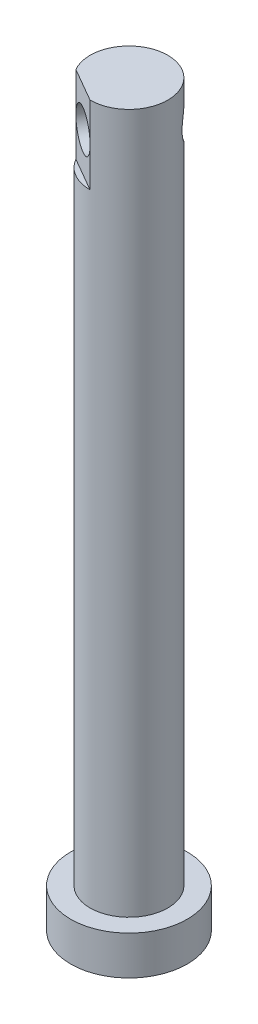
ISO-10303-21;
HEADER;
FILE_DESCRIPTION(('STEP AP214'),'2;1');
FILE_NAME('part.step','',(''),(''),'','','');
FILE_SCHEMA(('AUTOMOTIVE_DESIGN { 1 0 10303 214 1 1 1 1 }'));
ENDSEC;
DATA;
#1=APPLICATION_CONTEXT('core data for automotive mechanical design processes');
#2=APPLICATION_PROTOCOL_DEFINITION('international standard','automotive_design',2000,#1);
#3=PRODUCT_CONTEXT('',#1,'mechanical');
#4=PRODUCT('Part','Part','',(#3));
#5=PRODUCT_RELATED_PRODUCT_CATEGORY('part','',(#4));
#6=PRODUCT_DEFINITION_FORMATION('','',#4);
#7=PRODUCT_DEFINITION_CONTEXT('part definition',#1,'design');
#8=PRODUCT_DEFINITION('design','',#6,#7);
#9=PRODUCT_DEFINITION_SHAPE('','',#8);
#10=(LENGTH_UNIT() NAMED_UNIT(*) SI_UNIT(.MILLI.,.METRE.));
#11=(NAMED_UNIT(*) PLANE_ANGLE_UNIT() SI_UNIT($,.RADIAN.));
#12=(NAMED_UNIT(*) SI_UNIT($,.STERADIAN.) SOLID_ANGLE_UNIT());
#13=UNCERTAINTY_MEASURE_WITH_UNIT(LENGTH_MEASURE(1.E-05),#10,'distance_accuracy_value','');
#14=(GEOMETRIC_REPRESENTATION_CONTEXT(3) GLOBAL_UNCERTAINTY_ASSIGNED_CONTEXT((#13)) GLOBAL_UNIT_ASSIGNED_CONTEXT((#10,
#11,#12)) REPRESENTATION_CONTEXT('',''));
#15=CARTESIAN_POINT('',(0.,0.,0.));
#16=DIRECTION('',(0.,0.,1.));
#17=DIRECTION('',(1.,0.,0.));
#18=AXIS2_PLACEMENT_3D('',#15,#16,#17);
#19=CARTESIAN_POINT('',(40.8101485104643,85.,35.2115346363792));
#20=DIRECTION('',(0.500176620154735,0.,-0.865923408074055));
#21=DIRECTION('',(-0.865923408074055,0.,-0.500176620154735));
#22=AXIS2_PLACEMENT_3D('',#19,#20,#21);
#23=PLANE('',#22);
#24=DIRECTION('',(0.,1.,0.));
#25=VECTOR('',#24,1.);
#26=CARTESIAN_POINT('',(36.4790020748308,85.,32.709768122885));
#27=LINE('',#26,#25);
#28=CARTESIAN_POINT('',(36.4790020748308,90.,32.709768122885));
#29=VERTEX_POINT('',#28);
#30=CARTESIAN_POINT('',(36.4790020748308,95.,32.709768122885));
#31=VERTEX_POINT('',#30);
#32=EDGE_CURVE('E69',#29,#31,#27,.T.);
#33=ORIENTED_EDGE('',*,*,#32,.F.);
#34=CARTESIAN_POINT('',(38.6445752926476,90.,33.9606513796321));
#35=DIRECTION('',(-0.500176620154735,0.,0.865923408074055));
#36=DIRECTION('',(0.865923408074055,0.,0.500176620154735));
#37=AXIS2_PLACEMENT_3D('',#34,#35,#36);
#38=CIRCLE('',#37,2.50088310077368);
#39=CARTESIAN_POINT('',(40.8101485104643,90.,35.2115346363792));
#40=VERTEX_POINT('',#39);
#41=EDGE_CURVE('E46',#40,#29,#38,.T.);
#42=ORIENTED_EDGE('',*,*,#41,.F.);
#43=DIRECTION('',(0.,1.,0.));
#44=VECTOR('',#43,1.);
#45=CARTESIAN_POINT('',(40.8101485104643,85.,35.2115346363792));
#46=LINE('',#45,#44);
#47=CARTESIAN_POINT('',(40.8101485104643,95.,35.2115346363792));
#48=VERTEX_POINT('',#47);
#49=EDGE_CURVE('E52',#40,#48,#46,.T.);
#50=ORIENTED_EDGE('',*,*,#49,.T.);
#51=DIRECTION('',(-0.865923408074055,0.,-0.500176620154735));
#52=VECTOR('',#51,1.);
#53=CARTESIAN_POINT('',(40.8101485104643,95.,35.2115346363792));
#54=LINE('',#53,#52);
#55=EDGE_CURVE('E90',#48,#31,#54,.T.);
#56=ORIENTED_EDGE('',*,*,#55,.T.);
#57=EDGE_LOOP('',(#33,#42,#50,#56));
#58=FACE_BOUND('',#57,.T.);
#59=ADVANCED_FACE('F32',(#58),#23,.F.);
#60=CARTESIAN_POINT('',(40.8101485104643,5.,30.2115346363792));
#61=DIRECTION('',(0.,-1.,0.));
#62=DIRECTION('',(0.,0.,-1.));
#63=AXIS2_PLACEMENT_3D('',#60,#61,#62);
#64=CYLINDRICAL_SURFACE('',#63,7.5);
#65=CARTESIAN_POINT('',(40.8101485104643,5.,30.2115346363792));
#66=DIRECTION('',(0.,1.,0.));
#67=DIRECTION('',(0.,0.,1.));
#68=AXIS2_PLACEMENT_3D('',#65,#66,#67);
#69=CIRCLE('',#68,7.5);
#70=CARTESIAN_POINT('',(40.8101485104643,5.,37.7115346363792));
#71=VERTEX_POINT('',#70);
#72=EDGE_CURVE('E98',#71,#71,#69,.T.);
#73=ORIENTED_EDGE('',*,*,#72,.F.);
#74=EDGE_LOOP('',(#73));
#75=FACE_BOUND('',#74,.T.);
#76=CARTESIAN_POINT('',(40.8101485104643,0.,30.2115346363792));
#77=DIRECTION('',(0.,1.,0.));
#78=DIRECTION('',(0.,0.,1.));
#79=AXIS2_PLACEMENT_3D('',#76,#77,#78);
#80=CIRCLE('',#79,7.5);
#81=CARTESIAN_POINT('',(40.8101485104643,0.,37.7115346363792));
#82=VERTEX_POINT('',#81);
#83=EDGE_CURVE('E95',#82,#82,#80,.T.);
#84=ORIENTED_EDGE('',*,*,#83,.T.);
#85=EDGE_LOOP('',(#84));
#86=FACE_BOUND('',#85,.T.);
#87=ADVANCED_FACE('F34',(#75,#86),#64,.T.);
#88=CARTESIAN_POINT('',(40.8101485104643,5.,30.2115346363792));
#89=DIRECTION('',(0.,1.,0.));
#90=DIRECTION('',(0.,0.,1.));
#91=AXIS2_PLACEMENT_3D('',#88,#89,#90);
#92=PLANE('',#91);
#93=CARTESIAN_POINT('',(40.8101485104643,5.,30.2115346363792));
#94=DIRECTION('',(0.,1.,0.));
#95=DIRECTION('',(0.,0.,1.));
#96=AXIS2_PLACEMENT_3D('',#93,#94,#95);
#97=CIRCLE('',#96,5.);
#98=CARTESIAN_POINT('',(40.8101485104643,5.,35.2115346363792));
#99=VERTEX_POINT('',#98);
#100=EDGE_CURVE('E93',#99,#99,#97,.T.);
#101=ORIENTED_EDGE('',*,*,#100,.F.);
#102=EDGE_LOOP('',(#101));
#103=FACE_BOUND('',#102,.T.);
#104=ORIENTED_EDGE('',*,*,#72,.T.);
#105=EDGE_LOOP('',(#104));
#106=FACE_BOUND('',#105,.T.);
#107=ADVANCED_FACE('F131',(#103,#106),#92,.T.);
#108=CARTESIAN_POINT('',(40.8101485104643,0.,30.2115346363792));
#109=DIRECTION('',(0.,1.,0.));
#110=DIRECTION('',(0.,0.,1.));
#111=AXIS2_PLACEMENT_3D('',#108,#109,#110);
#112=PLANE('',#111);
#113=ORIENTED_EDGE('',*,*,#83,.F.);
#114=EDGE_LOOP('',(#113));
#115=FACE_BOUND('',#114,.T.);
#116=ADVANCED_FACE('F125',(#115),#112,.F.);
#117=CARTESIAN_POINT('',(40.8101485104643,95.,30.2115346363792));
#118=DIRECTION('',(0.,-1.,0.));
#119=DIRECTION('',(0.,0.,-1.));
#120=AXIS2_PLACEMENT_3D('',#117,#118,#119);
#121=CYLINDRICAL_SURFACE('',#120,5.);
#122=CARTESIAN_POINT('',(40.8101485104643,90.,25.2115346363792));
#123=CARTESIAN_POINT('',(40.8101640389905,89.8696946402913,25.2115287988634));
#124=CARTESIAN_POINT('',(40.8220141819466,89.7392196812945,25.2114910448922));
#125=CARTESIAN_POINT('',(40.8685352505051,89.4822777106961,25.2118250085867));
#126=CARTESIAN_POINT('',(40.9032540951752,89.3558197007195,25.212197587167));
#127=CARTESIAN_POINT('',(40.9928618949006,89.1111098833826,25.2146762011308));
#128=CARTESIAN_POINT('',(41.0476435306092,88.9928183218207,25.2167730858899));
#129=CARTESIAN_POINT('',(41.1744505467542,88.7660787560713,25.2244205965037));
#130=CARTESIAN_POINT('',(41.2464768705032,88.6576312908196,25.2299714113207));
#131=CARTESIAN_POINT('',(41.411447191864,88.4437731858497,25.2470749701114));
#132=CARTESIAN_POINT('',(41.5056270248596,88.3393520311528,25.2590852937575));
#133=CARTESIAN_POINT('',(41.7074485176245,88.1459073165113,25.2916460296547));
#134=CARTESIAN_POINT('',(41.8150968504202,88.0568914416454,25.3122006870387));
#135=CARTESIAN_POINT('',(42.0481236230354,87.8909056870733,25.365646563883));
#136=CARTESIAN_POINT('',(42.1742082655684,87.8151536879487,25.3992765301154));
#137=CARTESIAN_POINT('',(42.4333475231836,87.6863735383714,25.4804031394923));
#138=CARTESIAN_POINT('',(42.5663976767018,87.6333310370885,25.5278909934072));
#139=CARTESIAN_POINT('',(42.824740845215,87.5553967699102,25.6333825485471));
#140=CARTESIAN_POINT('',(42.9499117200426,87.5287696435371,25.6903968484558));
#141=CARTESIAN_POINT('',(43.1971954063417,87.4987065371034,25.8159471105894));
#142=CARTESIAN_POINT('',(43.3193100249678,87.4952565134999,25.8844760700063));
#143=CARTESIAN_POINT('',(43.5458304035071,87.5109768830375,26.0243840895716));
#144=CARTESIAN_POINT('',(43.6508524752833,87.5282049574277,26.0949961894704));
#145=CARTESIAN_POINT('',(43.852153943557,87.5813159542473,26.2414340940987));
#146=CARTESIAN_POINT('',(43.9484326851722,87.6172002726924,26.3172602886217));
#147=CARTESIAN_POINT('',(44.1317476384291,87.7068366108683,26.4723359300081));
#148=CARTESIAN_POINT('',(44.2186376376814,87.7608288391831,26.551618214259));
#149=CARTESIAN_POINT('',(44.3807408380147,87.8848155950612,26.7095782544098));
#150=CARTESIAN_POINT('',(44.4559498433924,87.9548158503388,26.7882557834867));
#151=CARTESIAN_POINT('',(44.6009822834816,88.1164367563388,26.9492653704311));
#152=CARTESIAN_POINT('',(44.6696236438809,88.2094760573071,27.0312393112039));
#153=CARTESIAN_POINT('',(44.7927841630892,88.4107378640181,27.1868885057844));
#154=CARTESIAN_POINT('',(44.8472924537817,88.5189719563235,27.2605573486393));
#155=CARTESIAN_POINT('',(44.9454648749012,88.7559749251807,27.3996202161222));
#156=CARTESIAN_POINT('',(44.9882191481219,88.8856118913927,27.4641902876817));
#157=CARTESIAN_POINT('',(45.0581791937492,89.1568340832633,27.5736383741277));
#158=CARTESIAN_POINT('',(45.0854012038379,89.2984066528197,27.6185369424815));
#159=CARTESIAN_POINT('',(45.1227674868192,89.5776788103114,27.6812066511634));
#160=CARTESIAN_POINT('',(45.1340943706528,89.7147959296249,27.7008459181305));
#161=CARTESIAN_POINT('',(45.1434889354564,89.9908012746173,27.7170865788027));
#162=CARTESIAN_POINT('',(45.1415659977752,90.1296881776936,27.7137042726278));
#163=CARTESIAN_POINT('',(45.125444465837,90.3890734917089,27.6859836470156));
#164=CARTESIAN_POINT('',(45.1126131910098,90.5099200794489,27.6639806999245));
#165=CARTESIAN_POINT('',(45.0765418031979,90.7459562842286,27.6040257178232));
#166=CARTESIAN_POINT('',(45.05329831625,90.8611440541541,27.5660685132569));
#167=CARTESIAN_POINT('',(44.9950956979672,91.0886634650572,27.4748835623561));
#168=CARTESIAN_POINT('',(44.9596438510654,91.2006157875749,27.421030025583));
#169=CARTESIAN_POINT('',(44.8772393039748,91.4139073334491,27.3022399262831));
#170=CARTESIAN_POINT('',(44.8302806933334,91.5152410642532,27.2372976732481));
#171=CARTESIAN_POINT('',(44.7179592654596,91.7177940271481,27.0908690523793));
#172=CARTESIAN_POINT('',(44.6510219706358,91.817385902962,27.0083291220684));
#173=CARTESIAN_POINT('',(44.502010653454,91.9990128280881,26.8376667634882));
#174=CARTESIAN_POINT('',(44.4199315240242,92.0810419335612,26.7495424583118));
#175=CARTESIAN_POINT('',(44.2384697762654,92.2270493294117,26.5696477326495));
#176=CARTESIAN_POINT('',(44.138686738333,92.2904925027512,26.4778425373492));
#177=CARTESIAN_POINT('',(43.9247898803663,92.393585352802,26.2976495512052));
#178=CARTESIAN_POINT('',(43.8106887597888,92.4332559367752,26.2092588216491));
#179=CARTESIAN_POINT('',(43.5821350577632,92.4842557617717,26.0481438260082));
#180=CARTESIAN_POINT('',(43.4686761686193,92.4978522966821,25.9747262650589));
#181=CARTESIAN_POINT('',(43.2357809710891,92.50300375319,25.8372271738469));
#182=CARTESIAN_POINT('',(43.1163467726185,92.4945664019467,25.7731423789578));
#183=CARTESIAN_POINT('',(42.8835390227153,92.4573904645356,25.6599727699078));
#184=CARTESIAN_POINT('',(42.7702854399851,92.4300278861477,25.6101773018946));
#185=CARTESIAN_POINT('',(42.5454513188427,92.3576349177756,25.5207595381545));
#186=CARTESIAN_POINT('',(42.4338710225751,92.3126019958143,25.4811387016934));
#187=CARTESIAN_POINT('',(42.2108003988212,92.2041425007534,25.4102368989165));
#188=CARTESIAN_POINT('',(42.0995178403376,92.1400118952096,25.379384875102));
#189=CARTESIAN_POINT('',(41.8851683483862,91.996064332352,25.327220849415));
#190=CARTESIAN_POINT('',(41.7821052185566,91.9162401711892,25.30591324352));
#191=CARTESIAN_POINT('',(41.5772667294168,91.7339441101429,25.2695311758535));
#192=CARTESIAN_POINT('',(41.476641638476,91.6300084865221,25.2552887197662));
#193=CARTESIAN_POINT('',(41.2923397127416,91.4072773057186,25.2339734109314));
#194=CARTESIAN_POINT('',(41.2086779004903,91.2884687264406,25.2269068911318));
#195=CARTESIAN_POINT('',(41.0600079845815,91.0341749907028,25.217204535603));
#196=CARTESIAN_POINT('',(40.9956755094284,90.8982804866114,25.2147163014924));
#197=CARTESIAN_POINT('',(40.919450899267,90.6874722436651,25.2126663369884));
#198=CARTESIAN_POINT('',(40.8974324952013,90.6161094508738,25.2122630198545));
#199=CARTESIAN_POINT('',(40.8605464418002,90.4715746003791,25.2117541134118));
#200=CARTESIAN_POINT('',(40.8456737943311,90.398403845039,25.2116483157496));
#201=CARTESIAN_POINT('',(40.8264571319076,90.2709655406008,25.2115547949172));
#202=CARTESIAN_POINT('',(40.8203510769372,90.2169577617939,25.2115428177369));
#203=CARTESIAN_POINT('',(40.8121933928937,90.1086431652913,25.2115339550623));
#204=CARTESIAN_POINT('',(40.8101420351889,90.0543363278243,25.2115370705781));
#205=CARTESIAN_POINT('',(40.8101485104643,90.,25.2115346363792));
#206=B_SPLINE_CURVE_WITH_KNOTS('',3,(#122,#123,#124,#125,#126,#127,#128,#129,#130,#131,#132,
#133,#134,#135,#136,#137,#138,#139,#140,#141,#142,#143,#144,#145,#146,#147,#148,#149,#150,#151,
#152,#153,#154,#155,#156,#157,#158,#159,#160,#161,#162,#163,#164,#165,#166,#167,#168,#169,#170,
#171,#172,#173,#174,#175,#176,#177,#178,#179,#180,#181,#182,#183,#184,#185,#186,#187,#188,#189,
#190,#191,#192,#193,#194,#195,#196,#197,#198,#199,#200,#201,#202,#203,#204,#205),.UNSPECIFIED.,
.T.,.F.,(4,2,2,2,2,2,2,2,2,2,2,2,2,2,2,2,2,2,2,2,2,2,2,2,2,2,2,2,2,2,2,2,2,2,2,2,2,2,2,2,2,4),
(0.,0.390696475743332,0.782214232215588,1.17166757249276,1.56114222137047,1.98276390231955,
2.40459531096039,2.85488626696425,3.30489224875461,3.72285946732115,4.14057340701665,
4.52193758902793,4.90333031199504,5.28999683363592,5.67680192264761,6.1001897387438,
6.52390217446475,6.97455520719141,7.42473625257953,7.83923446059232,8.25343921918375,
8.62228599479911,8.99125237772185,9.37730607349296,9.76355848305843,10.1985412250911,
10.6336709481978,11.0803153950153,11.5265664530621,11.931854373599,12.3370001810443,
12.7154182241629,13.0938905104771,13.4885425999081,13.8833762721625,14.3175282055996,
14.7520629571494,15.200376722908,15.4241291080557,15.6477247598617,15.8106312679613,
15.9735486785209),.UNSPECIFIED.);
#207=CARTESIAN_POINT('',(40.8101485104643,90.,25.2115346363792));
#208=VERTEX_POINT('',#207);
#209=EDGE_CURVE('E71',#208,#208,#206,.T.);
#210=ORIENTED_EDGE('',*,*,#209,.T.);
#211=EDGE_LOOP('',(#210));
#212=FACE_BOUND('',#211,.T.);
#213=CARTESIAN_POINT('',(40.8101485104643,95.,30.2115346363792));
#214=DIRECTION('',(0.,1.,0.));
#215=DIRECTION('',(0.,0.,1.));
#216=AXIS2_PLACEMENT_3D('',#213,#214,#215);
#217=CIRCLE('',#216,5.);
#218=EDGE_CURVE('E81',#48,#31,#217,.T.);
#219=ORIENTED_EDGE('',*,*,#218,.F.);
#220=ORIENTED_EDGE('',*,*,#49,.F.);
#221=CARTESIAN_POINT('',(40.8101485104643,85.,35.2115346363792));
#222=VERTEX_POINT('',#221);
#223=EDGE_CURVE('E79',#222,#40,#46,.T.);
#224=ORIENTED_EDGE('',*,*,#223,.F.);
#225=CARTESIAN_POINT('',(40.8101485104643,85.,30.2115346363792));
#226=DIRECTION('',(0.,-1.,0.));
#227=DIRECTION('',(0.,0.,-1.));
#228=AXIS2_PLACEMENT_3D('',#225,#226,#227);
#229=CIRCLE('',#228,5.);
#230=CARTESIAN_POINT('',(36.4790020748308,85.,32.709768122885));
#231=VERTEX_POINT('',#230);
#232=EDGE_CURVE('E40',#222,#231,#229,.T.);
#233=ORIENTED_EDGE('',*,*,#232,.T.);
#234=EDGE_CURVE('E87',#231,#29,#27,.T.);
#235=ORIENTED_EDGE('',*,*,#234,.T.);
#236=ORIENTED_EDGE('',*,*,#32,.T.);
#237=EDGE_LOOP('',(#219,#220,#224,#233,#235,#236));
#238=FACE_BOUND('',#237,.T.);
#239=ORIENTED_EDGE('',*,*,#100,.T.);
#240=EDGE_LOOP('',(#239));
#241=FACE_BOUND('',#240,.T.);
#242=ADVANCED_FACE('F76',(#212,#238,#241),#121,.T.);
#243=CARTESIAN_POINT('',(40.8101485104643,95.,30.2115346363792));
#244=DIRECTION('',(0.,1.,0.));
#245=DIRECTION('',(0.,0.,1.));
#246=AXIS2_PLACEMENT_3D('',#243,#244,#245);
#247=PLANE('',#246);
#248=ORIENTED_EDGE('',*,*,#55,.F.);
#249=ORIENTED_EDGE('',*,*,#218,.T.);
#250=EDGE_LOOP('',(#248,#249));
#251=FACE_BOUND('',#250,.T.);
#252=ADVANCED_FACE('F118',(#251),#247,.T.);
#253=CARTESIAN_POINT('',(0.,85.,0.));
#254=DIRECTION('',(0.,-1.,0.));
#255=DIRECTION('',(0.,0.,-1.));
#256=AXIS2_PLACEMENT_3D('',#253,#254,#255);
#257=PLANE('',#256);
#258=DIRECTION('',(-0.865923408074055,0.,-0.500176620154735));
#259=VECTOR('',#258,1.);
#260=CARTESIAN_POINT('',(40.8101485104643,85.,35.2115346363792));
#261=LINE('',#260,#259);
#262=EDGE_CURVE('E82',#222,#231,#261,.T.);
#263=ORIENTED_EDGE('',*,*,#262,.T.);
#264=ORIENTED_EDGE('',*,*,#232,.F.);
#265=EDGE_LOOP('',(#263,#264));
#266=FACE_BOUND('',#265,.T.);
#267=ADVANCED_FACE('F103',(#266),#257,.F.);
#268=ORIENTED_EDGE('',*,*,#223,.T.);
#269=CARTESIAN_POINT('',(38.6445752926476,90.,33.9606513796321));
#270=DIRECTION('',(0.500176620154735,0.,-0.865923408074055));
#271=DIRECTION('',(-0.865923408074055,0.,-0.500176620154735));
#272=AXIS2_PLACEMENT_3D('',#269,#270,#271);
#273=CIRCLE('',#272,2.50088310077368);
#274=EDGE_CURVE('E11',#40,#29,#273,.T.);
#275=ORIENTED_EDGE('',*,*,#274,.T.);
#276=ORIENTED_EDGE('',*,*,#234,.F.);
#277=ORIENTED_EDGE('',*,*,#262,.F.);
#278=EDGE_LOOP('',(#268,#275,#276,#277));
#279=FACE_BOUND('',#278,.T.);
#280=ADVANCED_FACE('F85',(#279),#23,.F.);
#281=CARTESIAN_POINT('',(43.6463414941949,90.,25.3014172988916));
#282=DIRECTION('',(-0.500176620154735,0.,0.865923408074055));
#283=DIRECTION('',(0.865923408074055,0.,0.500176620154735));
#284=AXIS2_PLACEMENT_3D('',#281,#282,#283);
#285=CYLINDRICAL_SURFACE('',#284,2.50088310077368);
#286=ORIENTED_EDGE('',*,*,#41,.T.);
#287=ORIENTED_EDGE('',*,*,#274,.F.);
#288=EDGE_LOOP('',(#286,#287));
#289=FACE_BOUND('',#288,.T.);
#290=ORIENTED_EDGE('',*,*,#209,.F.);
#291=EDGE_LOOP('',(#290));
#292=FACE_BOUND('',#291,.T.);
#293=ADVANCED_FACE('F64',(#289,#292),#285,.F.);
#294=CLOSED_SHELL('',(#59,#87,#107,#116,#242,#252,#267,#280,#293));
#295=MANIFOLD_SOLID_BREP('B2',#294);
#296=ADVANCED_BREP_SHAPE_REPRESENTATION('',(#18,#295),#14);
#297=SHAPE_DEFINITION_REPRESENTATION(#9,#296);
ENDSEC;
END-ISO-10303-21;
